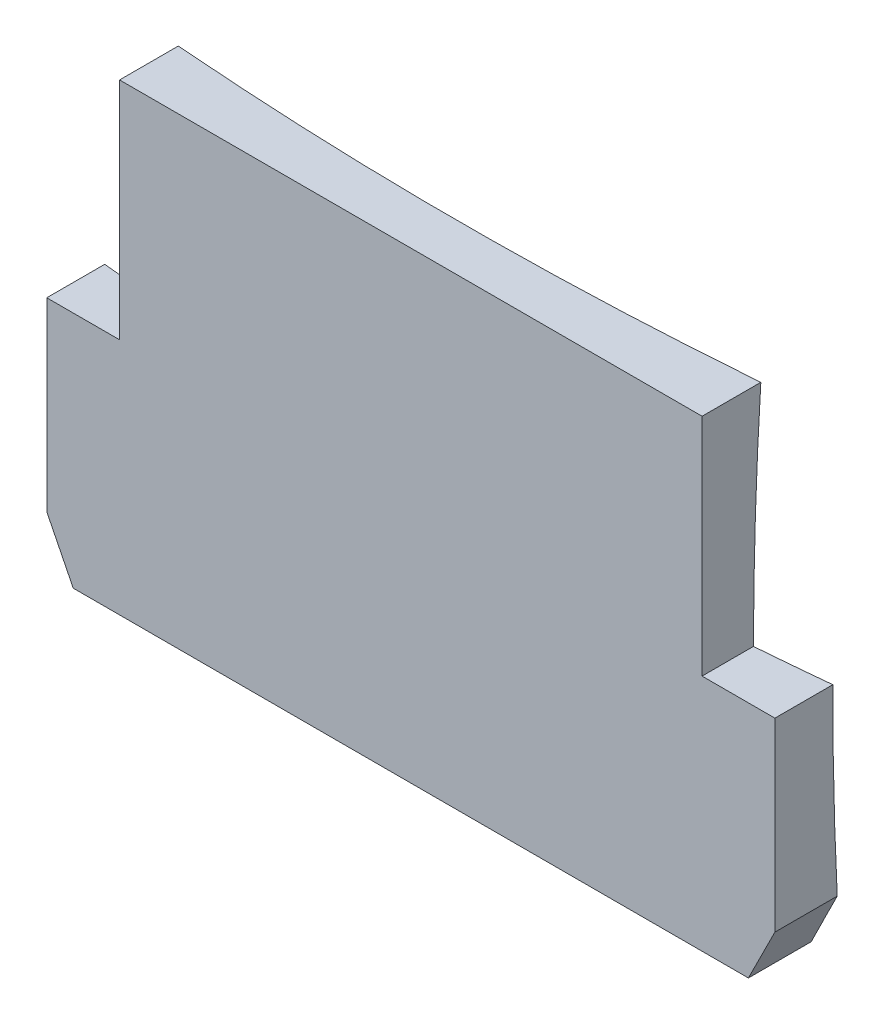
ISO-10303-21;
HEADER;
FILE_DESCRIPTION(('STEP AP214'),'2;1');
FILE_NAME('part.step','',(''),(''),'','','');
FILE_SCHEMA(('AUTOMOTIVE_DESIGN { 1 0 10303 214 1 1 1 1 }'));
ENDSEC;
DATA;
#1=APPLICATION_CONTEXT('core data for automotive mechanical design processes');
#2=APPLICATION_PROTOCOL_DEFINITION('international standard','automotive_design',2000,#1);
#3=PRODUCT_CONTEXT('',#1,'mechanical');
#4=PRODUCT('Part','Part','',(#3));
#5=PRODUCT_RELATED_PRODUCT_CATEGORY('part','',(#4));
#6=PRODUCT_DEFINITION_FORMATION('','',#4);
#7=PRODUCT_DEFINITION_CONTEXT('part definition',#1,'design');
#8=PRODUCT_DEFINITION('design','',#6,#7);
#9=PRODUCT_DEFINITION_SHAPE('','',#8);
#10=(LENGTH_UNIT() NAMED_UNIT(*) SI_UNIT(.MILLI.,.METRE.));
#11=(NAMED_UNIT(*) PLANE_ANGLE_UNIT() SI_UNIT($,.RADIAN.));
#12=(NAMED_UNIT(*) SI_UNIT($,.STERADIAN.) SOLID_ANGLE_UNIT());
#13=UNCERTAINTY_MEASURE_WITH_UNIT(LENGTH_MEASURE(1.E-05),#10,'distance_accuracy_value','');
#14=(GEOMETRIC_REPRESENTATION_CONTEXT(3) GLOBAL_UNCERTAINTY_ASSIGNED_CONTEXT((#13)) GLOBAL_UNIT_ASSIGNED_CONTEXT((#10,
#11,#12)) REPRESENTATION_CONTEXT('',''));
#15=CARTESIAN_POINT('',(0.,0.,0.));
#16=DIRECTION('',(0.,0.,1.));
#17=DIRECTION('',(1.,0.,0.));
#18=AXIS2_PLACEMENT_3D('',#15,#16,#17);
#19=CARTESIAN_POINT('',(-27.5,-17.5,-8.));
#20=DIRECTION('',(-1.,0.,0.));
#21=DIRECTION('',(0.,0.,1.));
#22=AXIS2_PLACEMENT_3D('',#19,#20,#21);
#23=PLANE('',#22);
#24=CARTESIAN_POINT('',(-27.5,0.,-278.4));
#25=DIRECTION('',(-1.,0.,0.));
#26=DIRECTION('',(0.,0.,1.));
#27=AXIS2_PLACEMENT_3D('',#24,#25,#26);
#28=CIRCLE('',#27,274.023557381478);
#29=CARTESIAN_POINT('',(-27.5,-13.5,-4.70918904720236));
#30=VERTEX_POINT('',#29);
#31=CARTESIAN_POINT('',(-27.5,0.5,-4.37689878406233));
#32=VERTEX_POINT('',#31);
#33=EDGE_CURVE('E147',#30,#32,#28,.T.);
#34=ORIENTED_EDGE('',*,*,#33,.F.);
#35=DIRECTION('',(0.,0.,1.));
#36=VECTOR('',#35,1.);
#37=CARTESIAN_POINT('',(-27.5,-13.5,-8.));
#38=LINE('',#37,#36);
#39=CARTESIAN_POINT('',(-27.5,-13.5,0.));
#40=VERTEX_POINT('',#39);
#41=EDGE_CURVE('E145',#30,#40,#38,.T.);
#42=ORIENTED_EDGE('',*,*,#41,.T.);
#43=DIRECTION('',(0.,-1.,0.));
#44=VECTOR('',#43,1.);
#45=CARTESIAN_POINT('',(-27.5,-17.5,0.));
#46=LINE('',#45,#44);
#47=CARTESIAN_POINT('',(-27.5,0.5,0.));
#48=VERTEX_POINT('',#47);
#49=EDGE_CURVE('E140',#48,#40,#46,.T.);
#50=ORIENTED_EDGE('',*,*,#49,.F.);
#51=DIRECTION('',(0.,0.,1.));
#52=VECTOR('',#51,1.);
#53=CARTESIAN_POINT('',(-27.5,0.5,-4.93581587344932));
#54=LINE('',#53,#52);
#55=EDGE_CURVE('E125',#32,#48,#54,.T.);
#56=ORIENTED_EDGE('',*,*,#55,.F.);
#57=EDGE_LOOP('',(#34,#42,#50,#56));
#58=FACE_BOUND('',#57,.T.);
#59=ADVANCED_FACE('F48',(#58),#23,.T.);
#60=CARTESIAN_POINT('',(-27.5,17.5,-8.));
#61=DIRECTION('',(0.,1.,0.));
#62=DIRECTION('',(0.,0.,1.));
#63=AXIS2_PLACEMENT_3D('',#60,#61,#62);
#64=PLANE('',#63);
#65=DIRECTION('',(0.,0.,1.));
#66=VECTOR('',#65,1.);
#67=CARTESIAN_POINT('',(-22.,17.5,-4.93581587344932));
#68=LINE('',#67,#66);
#69=CARTESIAN_POINT('',(-22.,17.5,-4.43848810462444));
#70=VERTEX_POINT('',#69);
#71=CARTESIAN_POINT('',(-22.,17.5,0.));
#72=VERTEX_POINT('',#71);
#73=EDGE_CURVE('E234',#70,#72,#68,.T.);
#74=ORIENTED_EDGE('',*,*,#73,.T.);
#75=DIRECTION('',(-1.,0.,0.));
#76=VECTOR('',#75,1.);
#77=CARTESIAN_POINT('',(-27.5,17.5,0.));
#78=LINE('',#77,#76);
#79=CARTESIAN_POINT('',(22.,17.5,0.));
#80=VERTEX_POINT('',#79);
#81=EDGE_CURVE('E156',#80,#72,#78,.T.);
#82=ORIENTED_EDGE('',*,*,#81,.F.);
#83=DIRECTION('',(0.,0.,1.));
#84=VECTOR('',#83,1.);
#85=CARTESIAN_POINT('',(22.,17.5,-4.93581587344932));
#86=LINE('',#85,#84);
#87=CARTESIAN_POINT('',(22.,17.5,-4.43848810462438));
#88=VERTEX_POINT('',#87);
#89=EDGE_CURVE('E245',#88,#80,#86,.T.);
#90=ORIENTED_EDGE('',*,*,#89,.F.);
#91=CARTESIAN_POINT('',(0.,17.5,-278.4));
#92=DIRECTION('',(0.,1.,0.));
#93=DIRECTION('',(0.,0.,1.));
#94=AXIS2_PLACEMENT_3D('',#91,#92,#93);
#95=CIRCLE('',#94,274.843428155013);
#96=EDGE_CURVE('E151',#70,#88,#95,.T.);
#97=ORIENTED_EDGE('',*,*,#96,.F.);
#98=EDGE_LOOP('',(#74,#82,#90,#97));
#99=FACE_BOUND('',#98,.T.);
#100=ADVANCED_FACE('F200',(#99),#64,.T.);
#101=CARTESIAN_POINT('',(27.5,-17.5,-8.));
#102=DIRECTION('',(1.,0.,0.));
#103=DIRECTION('',(0.,0.,-1.));
#104=AXIS2_PLACEMENT_3D('',#101,#102,#103);
#105=PLANE('',#104);
#106=DIRECTION('',(0.,1.,0.));
#107=VECTOR('',#106,1.);
#108=CARTESIAN_POINT('',(27.5,-17.5,0.));
#109=LINE('',#108,#107);
#110=CARTESIAN_POINT('',(27.5,-13.5,0.));
#111=VERTEX_POINT('',#110);
#112=CARTESIAN_POINT('',(27.5,0.5,0.));
#113=VERTEX_POINT('',#112);
#114=EDGE_CURVE('E149',#111,#113,#109,.T.);
#115=ORIENTED_EDGE('',*,*,#114,.F.);
#116=DIRECTION('',(0.,0.,-1.));
#117=VECTOR('',#116,1.);
#118=CARTESIAN_POINT('',(27.5,-13.5,-8.));
#119=LINE('',#118,#117);
#120=CARTESIAN_POINT('',(27.5,-13.5,-4.70918904720236));
#121=VERTEX_POINT('',#120);
#122=EDGE_CURVE('E56',#111,#121,#119,.T.);
#123=ORIENTED_EDGE('',*,*,#122,.T.);
#124=CARTESIAN_POINT('',(27.5,0.,-278.4));
#125=DIRECTION('',(1.,0.,0.));
#126=DIRECTION('',(0.,0.,-1.));
#127=AXIS2_PLACEMENT_3D('',#124,#125,#126);
#128=CIRCLE('',#127,274.023557381478);
#129=CARTESIAN_POINT('',(27.5,0.5,-4.37689878406233));
#130=VERTEX_POINT('',#129);
#131=EDGE_CURVE('E194',#130,#121,#128,.T.);
#132=ORIENTED_EDGE('',*,*,#131,.F.);
#133=DIRECTION('',(0.,0.,1.));
#134=VECTOR('',#133,1.);
#135=CARTESIAN_POINT('',(27.5,0.5,-4.93581587344932));
#136=LINE('',#135,#134);
#137=EDGE_CURVE('E246',#130,#113,#136,.T.);
#138=ORIENTED_EDGE('',*,*,#137,.T.);
#139=EDGE_LOOP('',(#115,#123,#132,#138));
#140=FACE_BOUND('',#139,.T.);
#141=ADVANCED_FACE('F205',(#140),#105,.T.);
#142=CARTESIAN_POINT('',(-27.5,-17.5,-8.));
#143=DIRECTION('',(0.,-1.,0.));
#144=DIRECTION('',(0.,0.,-1.));
#145=AXIS2_PLACEMENT_3D('',#142,#143,#144);
#146=PLANE('',#145);
#147=CARTESIAN_POINT('',(0.,-17.5,-278.4));
#148=DIRECTION('',(0.,-1.,0.));
#149=DIRECTION('',(0.,0.,-1.));
#150=AXIS2_PLACEMENT_3D('',#147,#148,#149);
#151=CIRCLE('',#150,274.843428155013);
#152=CARTESIAN_POINT('',(25.5,-17.5,-4.74207484525499));
#153=VERTEX_POINT('',#152);
#154=CARTESIAN_POINT('',(-25.5,-17.5,-4.74207484525499));
#155=VERTEX_POINT('',#154);
#156=EDGE_CURVE('E158',#153,#155,#151,.T.);
#157=ORIENTED_EDGE('',*,*,#156,.F.);
#158=DIRECTION('',(0.,0.,1.));
#159=VECTOR('',#158,1.);
#160=CARTESIAN_POINT('',(25.5,-17.5,-8.));
#161=LINE('',#160,#159);
#162=CARTESIAN_POINT('',(25.5,-17.5,0.));
#163=VERTEX_POINT('',#162);
#164=EDGE_CURVE('E178',#153,#163,#161,.T.);
#165=ORIENTED_EDGE('',*,*,#164,.T.);
#166=DIRECTION('',(1.,0.,0.));
#167=VECTOR('',#166,1.);
#168=CARTESIAN_POINT('',(-27.5,-17.5,0.));
#169=LINE('',#168,#167);
#170=CARTESIAN_POINT('',(-25.5,-17.5,0.));
#171=VERTEX_POINT('',#170);
#172=EDGE_CURVE('E146',#171,#163,#169,.T.);
#173=ORIENTED_EDGE('',*,*,#172,.F.);
#174=DIRECTION('',(0.,0.,-1.));
#175=VECTOR('',#174,1.);
#176=CARTESIAN_POINT('',(-25.5,-17.5,-8.));
#177=LINE('',#176,#175);
#178=EDGE_CURVE('E173',#171,#155,#177,.T.);
#179=ORIENTED_EDGE('',*,*,#178,.T.);
#180=EDGE_LOOP('',(#157,#165,#173,#179));
#181=FACE_BOUND('',#180,.T.);
#182=ADVANCED_FACE('F185',(#181),#146,.T.);
#183=CARTESIAN_POINT('',(-27.5,17.5,0.));
#184=DIRECTION('',(0.,0.,-1.));
#185=DIRECTION('',(-1.,0.,0.));
#186=AXIS2_PLACEMENT_3D('',#183,#184,#185);
#187=PLANE('',#186);
#188=ORIENTED_EDGE('',*,*,#172,.T.);
#189=DIRECTION('',(-0.447213595499956,-0.894427190999917,0.));
#190=VECTOR('',#189,1.);
#191=CARTESIAN_POINT('',(25.5,-17.5,0.));
#192=LINE('',#191,#190);
#193=EDGE_CURVE('E70',#163,#111,#192,.F.);
#194=ORIENTED_EDGE('',*,*,#193,.T.);
#195=ORIENTED_EDGE('',*,*,#114,.T.);
#196=DIRECTION('',(1.,0.,0.));
#197=VECTOR('',#196,1.);
#198=CARTESIAN_POINT('',(27.5,0.5,0.));
#199=LINE('',#198,#197);
#200=CARTESIAN_POINT('',(22.,0.5,0.));
#201=VERTEX_POINT('',#200);
#202=EDGE_CURVE('E242',#201,#113,#199,.T.);
#203=ORIENTED_EDGE('',*,*,#202,.F.);
#204=DIRECTION('',(0.,-1.,0.));
#205=VECTOR('',#204,1.);
#206=CARTESIAN_POINT('',(22.,17.5,0.));
#207=LINE('',#206,#205);
#208=EDGE_CURVE('E236',#80,#201,#207,.T.);
#209=ORIENTED_EDGE('',*,*,#208,.F.);
#210=ORIENTED_EDGE('',*,*,#81,.T.);
#211=DIRECTION('',(0.,1.,0.));
#212=VECTOR('',#211,1.);
#213=CARTESIAN_POINT('',(-22.,17.5,0.));
#214=LINE('',#213,#212);
#215=CARTESIAN_POINT('',(-22.,0.5,0.));
#216=VERTEX_POINT('',#215);
#217=EDGE_CURVE('E136',#216,#72,#214,.T.);
#218=ORIENTED_EDGE('',*,*,#217,.F.);
#219=DIRECTION('',(1.,0.,0.));
#220=VECTOR('',#219,1.);
#221=CARTESIAN_POINT('',(-22.,0.5,0.));
#222=LINE('',#221,#220);
#223=EDGE_CURVE('E128',#48,#216,#222,.T.);
#224=ORIENTED_EDGE('',*,*,#223,.F.);
#225=ORIENTED_EDGE('',*,*,#49,.T.);
#226=DIRECTION('',(-0.447213595499956,0.894427190999917,0.));
#227=VECTOR('',#226,1.);
#228=CARTESIAN_POINT('',(-27.5,-13.5,0.));
#229=LINE('',#228,#227);
#230=EDGE_CURVE('E171',#40,#171,#229,.F.);
#231=ORIENTED_EDGE('',*,*,#230,.T.);
#232=EDGE_LOOP('',(#188,#194,#195,#203,#209,#210,#218,#224,#225,#231));
#233=FACE_BOUND('',#232,.T.);
#234=ADVANCED_FACE('F139',(#233),#187,.F.);
#235=CARTESIAN_POINT('',(0.,0.,-278.4));
#236=DIRECTION('',(0.,1.,0.));
#237=DIRECTION('',(0.,0.,1.));
#238=AXIS2_PLACEMENT_3D('',#235,#236,#237);
#239=SPHERICAL_SURFACE('',#238,275.4);
#240=ORIENTED_EDGE('',*,*,#131,.T.);
#241=CARTESIAN_POINT('',(27.4,-13.6999999999999,-278.4));
#242=DIRECTION('',(-0.894427190999917,0.447213595499955,0.));
#243=DIRECTION('',(-0.447213595499956,-0.894427190999917,0.));
#244=AXIS2_PLACEMENT_3D('',#241,#242,#243);
#245=CIRCLE('',#244,273.690902296733);
#246=EDGE_CURVE('E12',#121,#153,#245,.F.);
#247=ORIENTED_EDGE('',*,*,#246,.T.);
#248=ORIENTED_EDGE('',*,*,#156,.T.);
#249=CARTESIAN_POINT('',(-27.4,-13.6999999999999,-278.4));
#250=DIRECTION('',(0.894427190999917,0.447213595499955,0.));
#251=DIRECTION('',(-0.447213595499956,0.894427190999917,0.));
#252=AXIS2_PLACEMENT_3D('',#249,#250,#251);
#253=CIRCLE('',#252,273.690902296733);
#254=EDGE_CURVE('E176',#155,#30,#253,.F.);
#255=ORIENTED_EDGE('',*,*,#254,.T.);
#256=ORIENTED_EDGE('',*,*,#33,.T.);
#257=CARTESIAN_POINT('',(0.,0.5,-278.4));
#258=DIRECTION('',(0.,-1.,0.));
#259=DIRECTION('',(0.,0.,-1.));
#260=AXIS2_PLACEMENT_3D('',#257,#258,#259);
#261=CIRCLE('',#260,275.399546114368);
#262=CARTESIAN_POINT('',(-22.,0.5,-3.88058356465931));
#263=VERTEX_POINT('',#262);
#264=EDGE_CURVE('E131',#32,#263,#261,.F.);
#265=ORIENTED_EDGE('',*,*,#264,.T.);
#266=CARTESIAN_POINT('',(-22.,0.,-278.4));
#267=DIRECTION('',(1.,0.,0.));
#268=DIRECTION('',(0.,0.,-1.));
#269=AXIS2_PLACEMENT_3D('',#266,#267,#268);
#270=CIRCLE('',#269,274.519871776161);
#271=EDGE_CURVE('E167',#263,#70,#270,.F.);
#272=ORIENTED_EDGE('',*,*,#271,.T.);
#273=ORIENTED_EDGE('',*,*,#96,.T.);
#274=CARTESIAN_POINT('',(22.,0.,-278.4));
#275=DIRECTION('',(-1.,0.,0.));
#276=DIRECTION('',(0.,0.,1.));
#277=AXIS2_PLACEMENT_3D('',#274,#275,#276);
#278=CIRCLE('',#277,274.519871776161);
#279=CARTESIAN_POINT('',(22.,0.5,-3.88058356465931));
#280=VERTEX_POINT('',#279);
#281=EDGE_CURVE('E160',#88,#280,#278,.F.);
#282=ORIENTED_EDGE('',*,*,#281,.T.);
#283=CARTESIAN_POINT('',(0.,0.5,-278.4));
#284=DIRECTION('',(0.,-1.,0.));
#285=DIRECTION('',(0.,0.,-1.));
#286=AXIS2_PLACEMENT_3D('',#283,#284,#285);
#287=CIRCLE('',#286,275.399546114368);
#288=EDGE_CURVE('E163',#280,#130,#287,.F.);
#289=ORIENTED_EDGE('',*,*,#288,.T.);
#290=EDGE_LOOP('',(#240,#247,#248,#255,#256,#265,#272,#273,#282,#289));
#291=FACE_BOUND('',#290,.T.);
#292=ADVANCED_FACE('F193',(#291),#239,.F.);
#293=CARTESIAN_POINT('',(27.5,0.5,-4.93581587344932));
#294=DIRECTION('',(0.,-1.,0.));
#295=DIRECTION('',(0.,0.,-1.));
#296=AXIS2_PLACEMENT_3D('',#293,#294,#295);
#297=PLANE('',#296);
#298=DIRECTION('',(0.,0.,1.));
#299=VECTOR('',#298,1.);
#300=CARTESIAN_POINT('',(22.,0.5,-4.93581587344932));
#301=LINE('',#300,#299);
#302=EDGE_CURVE('E249',#280,#201,#301,.T.);
#303=ORIENTED_EDGE('',*,*,#302,.T.);
#304=ORIENTED_EDGE('',*,*,#202,.T.);
#305=ORIENTED_EDGE('',*,*,#137,.F.);
#306=ORIENTED_EDGE('',*,*,#288,.F.);
#307=EDGE_LOOP('',(#303,#304,#305,#306));
#308=FACE_BOUND('',#307,.T.);
#309=ADVANCED_FACE('F217',(#308),#297,.F.);
#310=CARTESIAN_POINT('',(22.,17.5,-4.93581587344932));
#311=DIRECTION('',(-1.,0.,0.));
#312=DIRECTION('',(0.,0.,1.));
#313=AXIS2_PLACEMENT_3D('',#310,#311,#312);
#314=PLANE('',#313);
#315=ORIENTED_EDGE('',*,*,#89,.T.);
#316=ORIENTED_EDGE('',*,*,#208,.T.);
#317=ORIENTED_EDGE('',*,*,#302,.F.);
#318=ORIENTED_EDGE('',*,*,#281,.F.);
#319=EDGE_LOOP('',(#315,#316,#317,#318));
#320=FACE_BOUND('',#319,.T.);
#321=ADVANCED_FACE('F218',(#320),#314,.F.);
#322=CARTESIAN_POINT('',(-22.,17.5,-4.93581587344932));
#323=DIRECTION('',(1.,0.,0.));
#324=DIRECTION('',(0.,0.,-1.));
#325=AXIS2_PLACEMENT_3D('',#322,#323,#324);
#326=PLANE('',#325);
#327=DIRECTION('',(0.,0.,1.));
#328=VECTOR('',#327,1.);
#329=CARTESIAN_POINT('',(-22.,0.5,-4.93581587344932));
#330=LINE('',#329,#328);
#331=EDGE_CURVE('E135',#263,#216,#330,.T.);
#332=ORIENTED_EDGE('',*,*,#331,.T.);
#333=ORIENTED_EDGE('',*,*,#217,.T.);
#334=ORIENTED_EDGE('',*,*,#73,.F.);
#335=ORIENTED_EDGE('',*,*,#271,.F.);
#336=EDGE_LOOP('',(#332,#333,#334,#335));
#337=FACE_BOUND('',#336,.T.);
#338=ADVANCED_FACE('F221',(#337),#326,.F.);
#339=CARTESIAN_POINT('',(-22.,0.5,-4.93581587344932));
#340=DIRECTION('',(0.,-1.,0.));
#341=DIRECTION('',(0.,0.,-1.));
#342=AXIS2_PLACEMENT_3D('',#339,#340,#341);
#343=PLANE('',#342);
#344=ORIENTED_EDGE('',*,*,#55,.T.);
#345=ORIENTED_EDGE('',*,*,#223,.T.);
#346=ORIENTED_EDGE('',*,*,#331,.F.);
#347=ORIENTED_EDGE('',*,*,#264,.F.);
#348=EDGE_LOOP('',(#344,#345,#346,#347));
#349=FACE_BOUND('',#348,.T.);
#350=ADVANCED_FACE('F127',(#349),#343,.F.);
#351=CARTESIAN_POINT('',(-27.5,-13.5,-8.));
#352=DIRECTION('',(0.894427190999917,0.447213595499955,0.));
#353=DIRECTION('',(-0.447213595499956,0.894427190999917,0.));
#354=AXIS2_PLACEMENT_3D('',#351,#352,#353);
#355=PLANE('',#354);
#356=ORIENTED_EDGE('',*,*,#254,.F.);
#357=ORIENTED_EDGE('',*,*,#178,.F.);
#358=ORIENTED_EDGE('',*,*,#230,.F.);
#359=ORIENTED_EDGE('',*,*,#41,.F.);
#360=EDGE_LOOP('',(#356,#357,#358,#359));
#361=FACE_BOUND('',#360,.T.);
#362=ADVANCED_FACE('F191',(#361),#355,.F.);
#363=CARTESIAN_POINT('',(25.5,-17.5,-8.));
#364=DIRECTION('',(-0.894427190999917,0.447213595499955,0.));
#365=DIRECTION('',(-0.447213595499956,-0.894427190999917,0.));
#366=AXIS2_PLACEMENT_3D('',#363,#364,#365);
#367=PLANE('',#366);
#368=ORIENTED_EDGE('',*,*,#246,.F.);
#369=ORIENTED_EDGE('',*,*,#122,.F.);
#370=ORIENTED_EDGE('',*,*,#193,.F.);
#371=ORIENTED_EDGE('',*,*,#164,.F.);
#372=EDGE_LOOP('',(#368,#369,#370,#371));
#373=FACE_BOUND('',#372,.T.);
#374=ADVANCED_FACE('F50',(#373),#367,.F.);
#375=CLOSED_SHELL('',(#59,#100,#141,#182,#234,#292,#309,#321,#338,#350,#362,#374));
#376=MANIFOLD_SOLID_BREP('B2',#375);
#377=ADVANCED_BREP_SHAPE_REPRESENTATION('',(#18,#376),#14);
#378=SHAPE_DEFINITION_REPRESENTATION(#9,#377);
ENDSEC;
END-ISO-10303-21;
